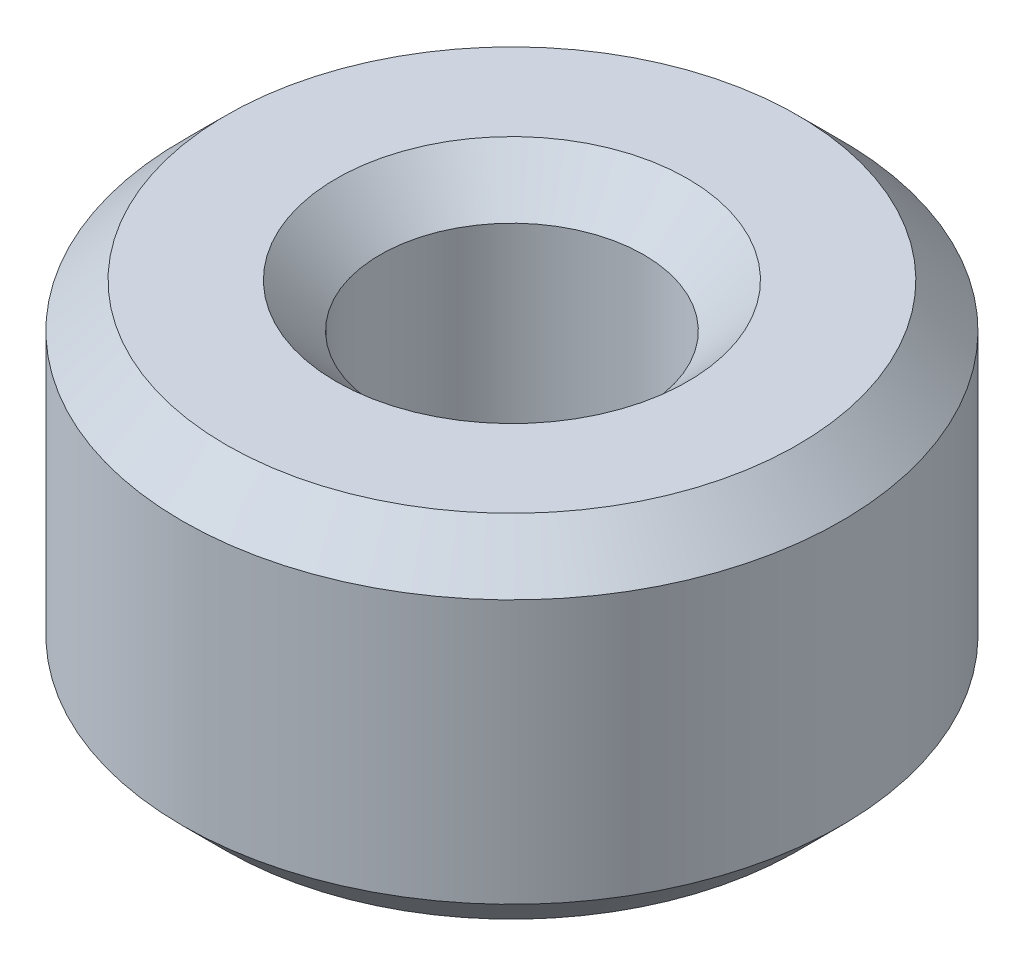
ISO-10303-21;
HEADER;
FILE_DESCRIPTION(('STEP AP214'),'2;1');
FILE_NAME('part.step','',(''),(''),'','','');
FILE_SCHEMA(('AUTOMOTIVE_DESIGN { 1 0 10303 214 1 1 1 1 }'));
ENDSEC;
DATA;
#1=APPLICATION_CONTEXT('core data for automotive mechanical design processes');
#2=APPLICATION_PROTOCOL_DEFINITION('international standard','automotive_design',2000,#1);
#3=PRODUCT_CONTEXT('',#1,'mechanical');
#4=PRODUCT('Part','Part','',(#3));
#5=PRODUCT_RELATED_PRODUCT_CATEGORY('part','',(#4));
#6=PRODUCT_DEFINITION_FORMATION('','',#4);
#7=PRODUCT_DEFINITION_CONTEXT('part definition',#1,'design');
#8=PRODUCT_DEFINITION('design','',#6,#7);
#9=PRODUCT_DEFINITION_SHAPE('','',#8);
#10=(LENGTH_UNIT() NAMED_UNIT(*) SI_UNIT(.MILLI.,.METRE.));
#11=(NAMED_UNIT(*) PLANE_ANGLE_UNIT() SI_UNIT($,.RADIAN.));
#12=(NAMED_UNIT(*) SI_UNIT($,.STERADIAN.) SOLID_ANGLE_UNIT());
#13=UNCERTAINTY_MEASURE_WITH_UNIT(LENGTH_MEASURE(1.E-05),#10,'distance_accuracy_value','');
#14=(GEOMETRIC_REPRESENTATION_CONTEXT(3) GLOBAL_UNCERTAINTY_ASSIGNED_CONTEXT((#13)) GLOBAL_UNIT_ASSIGNED_CONTEXT((#10,
#11,#12)) REPRESENTATION_CONTEXT('',''));
#15=CARTESIAN_POINT('',(0.,0.,0.));
#16=DIRECTION('',(0.,0.,1.));
#17=DIRECTION('',(1.,0.,0.));
#18=AXIS2_PLACEMENT_3D('',#15,#16,#17);
#19=CARTESIAN_POINT('',(0.,8.,0.));
#20=DIRECTION('',(0.,1.,0.));
#21=DIRECTION('',(0.,0.,1.));
#22=AXIS2_PLACEMENT_3D('',#19,#20,#21);
#23=PLANE('',#22);
#24=CARTESIAN_POINT('',(0.,8.,0.));
#25=DIRECTION('',(0.,1.,0.));
#26=DIRECTION('',(0.,0.,1.));
#27=AXIS2_PLACEMENT_3D('',#24,#25,#26);
#28=CIRCLE('',#27,4.);
#29=CARTESIAN_POINT('',(0.,8.,4.));
#30=VERTEX_POINT('',#29);
#31=EDGE_CURVE('E10',#30,#30,#28,.F.);
#32=ORIENTED_EDGE('',*,*,#31,.T.);
#33=EDGE_LOOP('',(#32));
#34=FACE_BOUND('',#33,.T.);
#35=CARTESIAN_POINT('',(0.,8.,0.));
#36=DIRECTION('',(0.,1.,0.));
#37=DIRECTION('',(0.,0.,1.));
#38=AXIS2_PLACEMENT_3D('',#35,#36,#37);
#39=CIRCLE('',#38,6.50000000000001);
#40=CARTESIAN_POINT('',(0.,8.,6.50000000000001));
#41=VERTEX_POINT('',#40);
#42=EDGE_CURVE('E56',#41,#41,#39,.T.);
#43=ORIENTED_EDGE('',*,*,#42,.T.);
#44=EDGE_LOOP('',(#43));
#45=FACE_BOUND('',#44,.T.);
#46=ADVANCED_FACE('F47',(#34,#45),#23,.T.);
#47=CARTESIAN_POINT('',(0.,0.,0.));
#48=DIRECTION('',(0.,1.,0.));
#49=DIRECTION('',(0.,0.,1.));
#50=AXIS2_PLACEMENT_3D('',#47,#48,#49);
#51=PLANE('',#50);
#52=CARTESIAN_POINT('',(0.,0.,0.));
#53=DIRECTION('',(0.,1.,0.));
#54=DIRECTION('',(0.,0.,1.));
#55=AXIS2_PLACEMENT_3D('',#52,#53,#54);
#56=CIRCLE('',#55,4.);
#57=CARTESIAN_POINT('',(0.,0.,4.));
#58=VERTEX_POINT('',#57);
#59=EDGE_CURVE('E80',#58,#58,#56,.T.);
#60=ORIENTED_EDGE('',*,*,#59,.T.);
#61=EDGE_LOOP('',(#60));
#62=FACE_BOUND('',#61,.T.);
#63=CARTESIAN_POINT('',(0.,0.,0.));
#64=DIRECTION('',(0.,1.,0.));
#65=DIRECTION('',(0.,0.,1.));
#66=AXIS2_PLACEMENT_3D('',#63,#64,#65);
#67=CIRCLE('',#66,6.49999999999999);
#68=CARTESIAN_POINT('',(0.,0.,6.49999999999999));
#69=VERTEX_POINT('',#68);
#70=EDGE_CURVE('E84',#69,#69,#67,.F.);
#71=ORIENTED_EDGE('',*,*,#70,.T.);
#72=EDGE_LOOP('',(#71));
#73=FACE_BOUND('',#72,.T.);
#74=ADVANCED_FACE('F89',(#62,#73),#51,.F.);
#75=CARTESIAN_POINT('',(0.,8.,0.));
#76=DIRECTION('',(0.,-1.,0.));
#77=DIRECTION('',(0.,0.,-1.));
#78=AXIS2_PLACEMENT_3D('',#75,#76,#77);
#79=CYLINDRICAL_SURFACE('',#78,7.5);
#80=CARTESIAN_POINT('',(0.,1.,0.));
#81=DIRECTION('',(0.,1.,0.));
#82=DIRECTION('',(0.,0.,1.));
#83=AXIS2_PLACEMENT_3D('',#80,#81,#82);
#84=CIRCLE('',#83,7.5);
#85=CARTESIAN_POINT('',(0.,1.,7.5));
#86=VERTEX_POINT('',#85);
#87=EDGE_CURVE('E61',#86,#86,#84,.T.);
#88=ORIENTED_EDGE('',*,*,#87,.T.);
#89=EDGE_LOOP('',(#88));
#90=FACE_BOUND('',#89,.T.);
#91=CARTESIAN_POINT('',(0.,7.,0.));
#92=DIRECTION('',(0.,1.,0.));
#93=DIRECTION('',(0.,0.,1.));
#94=AXIS2_PLACEMENT_3D('',#91,#92,#93);
#95=CIRCLE('',#94,7.5);
#96=CARTESIAN_POINT('',(0.,7.,7.5));
#97=VERTEX_POINT('',#96);
#98=EDGE_CURVE('E66',#97,#97,#95,.F.);
#99=ORIENTED_EDGE('',*,*,#98,.T.);
#100=EDGE_LOOP('',(#99));
#101=FACE_BOUND('',#100,.T.);
#102=ADVANCED_FACE('F99',(#90,#101),#79,.T.);
#103=CARTESIAN_POINT('',(0.,8.,0.));
#104=DIRECTION('',(0.,-1.,0.));
#105=DIRECTION('',(0.,0.,-1.));
#106=AXIS2_PLACEMENT_3D('',#103,#104,#105);
#107=CYLINDRICAL_SURFACE('',#106,3.);
#108=CARTESIAN_POINT('',(0.,1.,0.));
#109=DIRECTION('',(0.,1.,0.));
#110=DIRECTION('',(0.,0.,1.));
#111=AXIS2_PLACEMENT_3D('',#108,#109,#110);
#112=CIRCLE('',#111,3.);
#113=CARTESIAN_POINT('',(0.,1.,3.));
#114=VERTEX_POINT('',#113);
#115=EDGE_CURVE('E72',#114,#114,#112,.F.);
#116=ORIENTED_EDGE('',*,*,#115,.T.);
#117=EDGE_LOOP('',(#116));
#118=FACE_BOUND('',#117,.T.);
#119=CARTESIAN_POINT('',(0.,7.,0.));
#120=DIRECTION('',(0.,1.,0.));
#121=DIRECTION('',(0.,0.,1.));
#122=AXIS2_PLACEMENT_3D('',#119,#120,#121);
#123=CIRCLE('',#122,3.);
#124=CARTESIAN_POINT('',(0.,7.,3.));
#125=VERTEX_POINT('',#124);
#126=EDGE_CURVE('E76',#125,#125,#123,.T.);
#127=ORIENTED_EDGE('',*,*,#126,.T.);
#128=EDGE_LOOP('',(#127));
#129=FACE_BOUND('',#128,.T.);
#130=ADVANCED_FACE('F102',(#118,#129),#107,.F.);
#131=CARTESIAN_POINT('',(0.,0.,0.));
#132=DIRECTION('',(0.,-1.,0.));
#133=DIRECTION('',(0.,0.,-1.));
#134=AXIS2_PLACEMENT_3D('',#131,#132,#133);
#135=CONICAL_SURFACE('',#134,4.,0.785398163397446);
#136=ORIENTED_EDGE('',*,*,#115,.F.);
#137=EDGE_LOOP('',(#136));
#138=FACE_BOUND('',#137,.T.);
#139=ORIENTED_EDGE('',*,*,#59,.F.);
#140=EDGE_LOOP('',(#139));
#141=FACE_BOUND('',#140,.T.);
#142=ADVANCED_FACE('F95',(#138,#141),#135,.F.);
#143=CARTESIAN_POINT('',(0.,1.,0.));
#144=DIRECTION('',(0.,1.,0.));
#145=DIRECTION('',(0.,0.,1.));
#146=AXIS2_PLACEMENT_3D('',#143,#144,#145);
#147=CONICAL_SURFACE('',#146,7.5,0.78539816339745);
#148=ORIENTED_EDGE('',*,*,#70,.F.);
#149=EDGE_LOOP('',(#148));
#150=FACE_BOUND('',#149,.T.);
#151=ORIENTED_EDGE('',*,*,#87,.F.);
#152=EDGE_LOOP('',(#151));
#153=FACE_BOUND('',#152,.T.);
#154=ADVANCED_FACE('F91',(#150,#153),#147,.T.);
#155=CARTESIAN_POINT('',(0.,7.,0.));
#156=DIRECTION('',(0.,1.,0.));
#157=DIRECTION('',(0.,0.,1.));
#158=AXIS2_PLACEMENT_3D('',#155,#156,#157);
#159=CONICAL_SURFACE('',#158,3.,0.78539816339745);
#160=ORIENTED_EDGE('',*,*,#31,.F.);
#161=EDGE_LOOP('',(#160));
#162=FACE_BOUND('',#161,.T.);
#163=ORIENTED_EDGE('',*,*,#126,.F.);
#164=EDGE_LOOP('',(#163));
#165=FACE_BOUND('',#164,.T.);
#166=ADVANCED_FACE('F94',(#162,#165),#159,.F.);
#167=CARTESIAN_POINT('',(0.,8.,0.));
#168=DIRECTION('',(0.,-1.,0.));
#169=DIRECTION('',(0.,0.,-1.));
#170=AXIS2_PLACEMENT_3D('',#167,#168,#169);
#171=CONICAL_SURFACE('',#170,6.50000000000001,0.785398163397446);
#172=ORIENTED_EDGE('',*,*,#98,.F.);
#173=EDGE_LOOP('',(#172));
#174=FACE_BOUND('',#173,.T.);
#175=ORIENTED_EDGE('',*,*,#42,.F.);
#176=EDGE_LOOP('',(#175));
#177=FACE_BOUND('',#176,.T.);
#178=ADVANCED_FACE('F50',(#174,#177),#171,.T.);
#179=CLOSED_SHELL('',(#46,#74,#102,#130,#142,#154,#166,#178));
#180=MANIFOLD_SOLID_BREP('B2',#179);
#181=ADVANCED_BREP_SHAPE_REPRESENTATION('',(#18,#180),#14);
#182=SHAPE_DEFINITION_REPRESENTATION(#9,#181);
ENDSEC;
END-ISO-10303-21;
